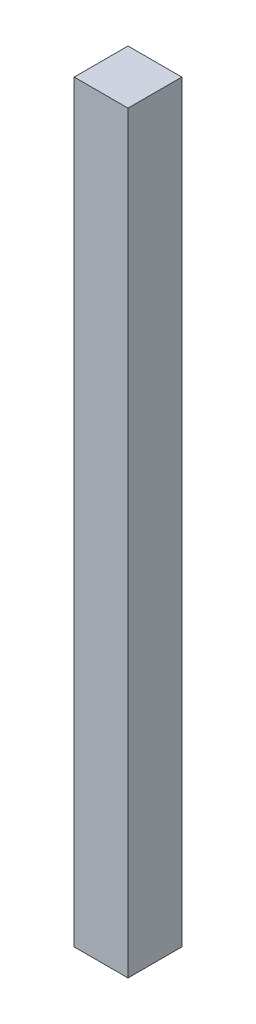
ISO-10303-21;
HEADER;
FILE_DESCRIPTION(('STEP AP214'),'2;1');
FILE_NAME('part.step','',(''),(''),'','','');
FILE_SCHEMA(('AUTOMOTIVE_DESIGN { 1 0 10303 214 1 1 1 1 }'));
ENDSEC;
DATA;
#1=APPLICATION_CONTEXT('core data for automotive mechanical design processes');
#2=APPLICATION_PROTOCOL_DEFINITION('international standard','automotive_design',2000,#1);
#3=PRODUCT_CONTEXT('',#1,'mechanical');
#4=PRODUCT('Part','Part','',(#3));
#5=PRODUCT_RELATED_PRODUCT_CATEGORY('part','',(#4));
#6=PRODUCT_DEFINITION_FORMATION('','',#4);
#7=PRODUCT_DEFINITION_CONTEXT('part definition',#1,'design');
#8=PRODUCT_DEFINITION('design','',#6,#7);
#9=PRODUCT_DEFINITION_SHAPE('','',#8);
#10=(LENGTH_UNIT() NAMED_UNIT(*) SI_UNIT(.MILLI.,.METRE.));
#11=(NAMED_UNIT(*) PLANE_ANGLE_UNIT() SI_UNIT($,.RADIAN.));
#12=(NAMED_UNIT(*) SI_UNIT($,.STERADIAN.) SOLID_ANGLE_UNIT());
#13=UNCERTAINTY_MEASURE_WITH_UNIT(LENGTH_MEASURE(1.E-05),#10,'distance_accuracy_value','');
#14=(GEOMETRIC_REPRESENTATION_CONTEXT(3) GLOBAL_UNCERTAINTY_ASSIGNED_CONTEXT((#13)) GLOBAL_UNIT_ASSIGNED_CONTEXT((#10,
#11,#12)) REPRESENTATION_CONTEXT('',''));
#15=CARTESIAN_POINT('',(0.,0.,0.));
#16=DIRECTION('',(0.,0.,1.));
#17=DIRECTION('',(1.,0.,0.));
#18=AXIS2_PLACEMENT_3D('',#15,#16,#17);
#19=CARTESIAN_POINT('',(-20.,560.,20.));
#20=DIRECTION('',(1.,0.,0.));
#21=DIRECTION('',(0.,0.,-1.));
#22=AXIS2_PLACEMENT_3D('',#19,#20,#21);
#23=PLANE('',#22);
#24=DIRECTION('',(0.,0.,1.));
#25=VECTOR('',#24,1.);
#26=CARTESIAN_POINT('',(-20.,0.,20.));
#27=LINE('',#26,#25);
#28=CARTESIAN_POINT('',(-20.,0.,-20.));
#29=VERTEX_POINT('',#28);
#30=CARTESIAN_POINT('',(-20.,0.,20.));
#31=VERTEX_POINT('',#30);
#32=EDGE_CURVE('E98',#29,#31,#27,.T.);
#33=ORIENTED_EDGE('',*,*,#32,.T.);
#34=DIRECTION('',(0.,-1.,0.));
#35=VECTOR('',#34,1.);
#36=CARTESIAN_POINT('',(-20.,560.,20.));
#37=LINE('',#36,#35);
#38=CARTESIAN_POINT('',(-20.,560.,20.));
#39=VERTEX_POINT('',#38);
#40=EDGE_CURVE('E11',#39,#31,#37,.T.);
#41=ORIENTED_EDGE('',*,*,#40,.F.);
#42=DIRECTION('',(0.,0.,1.));
#43=VECTOR('',#42,1.);
#44=CARTESIAN_POINT('',(-20.,560.,20.));
#45=LINE('',#44,#43);
#46=CARTESIAN_POINT('',(-20.,560.,-20.));
#47=VERTEX_POINT('',#46);
#48=EDGE_CURVE('E86',#47,#39,#45,.T.);
#49=ORIENTED_EDGE('',*,*,#48,.F.);
#50=DIRECTION('',(0.,-1.,0.));
#51=VECTOR('',#50,1.);
#52=CARTESIAN_POINT('',(-20.,560.,-20.));
#53=LINE('',#52,#51);
#54=EDGE_CURVE('E94',#47,#29,#53,.T.);
#55=ORIENTED_EDGE('',*,*,#54,.T.);
#56=EDGE_LOOP('',(#33,#41,#49,#55));
#57=FACE_BOUND('',#56,.T.);
#58=ADVANCED_FACE('F35',(#57),#23,.F.);
#59=CARTESIAN_POINT('',(20.,560.,20.));
#60=DIRECTION('',(0.,0.,-1.));
#61=DIRECTION('',(-1.,0.,0.));
#62=AXIS2_PLACEMENT_3D('',#59,#60,#61);
#63=PLANE('',#62);
#64=DIRECTION('',(1.,0.,0.));
#65=VECTOR('',#64,1.);
#66=CARTESIAN_POINT('',(20.,0.,20.));
#67=LINE('',#66,#65);
#68=CARTESIAN_POINT('',(20.,0.,20.));
#69=VERTEX_POINT('',#68);
#70=EDGE_CURVE('E90',#31,#69,#67,.T.);
#71=ORIENTED_EDGE('',*,*,#70,.T.);
#72=DIRECTION('',(0.,-1.,0.));
#73=VECTOR('',#72,1.);
#74=CARTESIAN_POINT('',(20.,560.,20.));
#75=LINE('',#74,#73);
#76=CARTESIAN_POINT('',(20.,560.,20.));
#77=VERTEX_POINT('',#76);
#78=EDGE_CURVE('E43',#77,#69,#75,.T.);
#79=ORIENTED_EDGE('',*,*,#78,.F.);
#80=DIRECTION('',(1.,0.,0.));
#81=VECTOR('',#80,1.);
#82=CARTESIAN_POINT('',(20.,560.,20.));
#83=LINE('',#82,#81);
#84=EDGE_CURVE('E81',#39,#77,#83,.T.);
#85=ORIENTED_EDGE('',*,*,#84,.F.);
#86=ORIENTED_EDGE('',*,*,#40,.T.);
#87=EDGE_LOOP('',(#71,#79,#85,#86));
#88=FACE_BOUND('',#87,.T.);
#89=ADVANCED_FACE('F89',(#88),#63,.F.);
#90=CARTESIAN_POINT('',(20.,560.,20.));
#91=DIRECTION('',(-1.,0.,0.));
#92=DIRECTION('',(0.,0.,1.));
#93=AXIS2_PLACEMENT_3D('',#90,#91,#92);
#94=PLANE('',#93);
#95=DIRECTION('',(0.,0.,-1.));
#96=VECTOR('',#95,1.);
#97=CARTESIAN_POINT('',(20.,0.,20.));
#98=LINE('',#97,#96);
#99=CARTESIAN_POINT('',(20.,0.,-20.));
#100=VERTEX_POINT('',#99);
#101=EDGE_CURVE('E68',#69,#100,#98,.T.);
#102=ORIENTED_EDGE('',*,*,#101,.T.);
#103=DIRECTION('',(0.,-1.,0.));
#104=VECTOR('',#103,1.);
#105=CARTESIAN_POINT('',(20.,560.,-20.));
#106=LINE('',#105,#104);
#107=CARTESIAN_POINT('',(20.,560.,-20.));
#108=VERTEX_POINT('',#107);
#109=EDGE_CURVE('E91',#108,#100,#106,.T.);
#110=ORIENTED_EDGE('',*,*,#109,.F.);
#111=DIRECTION('',(0.,0.,-1.));
#112=VECTOR('',#111,1.);
#113=CARTESIAN_POINT('',(20.,560.,20.));
#114=LINE('',#113,#112);
#115=EDGE_CURVE('E84',#77,#108,#114,.T.);
#116=ORIENTED_EDGE('',*,*,#115,.F.);
#117=ORIENTED_EDGE('',*,*,#78,.T.);
#118=EDGE_LOOP('',(#102,#110,#116,#117));
#119=FACE_BOUND('',#118,.T.);
#120=ADVANCED_FACE('F92',(#119),#94,.F.);
#121=CARTESIAN_POINT('',(20.,560.,-20.));
#122=DIRECTION('',(0.,0.,1.));
#123=DIRECTION('',(1.,0.,0.));
#124=AXIS2_PLACEMENT_3D('',#121,#122,#123);
#125=PLANE('',#124);
#126=DIRECTION('',(-1.,0.,0.));
#127=VECTOR('',#126,1.);
#128=CARTESIAN_POINT('',(20.,0.,-20.));
#129=LINE('',#128,#127);
#130=EDGE_CURVE('E74',#100,#29,#129,.T.);
#131=ORIENTED_EDGE('',*,*,#130,.T.);
#132=ORIENTED_EDGE('',*,*,#54,.F.);
#133=DIRECTION('',(-1.,0.,0.));
#134=VECTOR('',#133,1.);
#135=CARTESIAN_POINT('',(20.,560.,-20.));
#136=LINE('',#135,#134);
#137=EDGE_CURVE('E51',#108,#47,#136,.T.);
#138=ORIENTED_EDGE('',*,*,#137,.F.);
#139=ORIENTED_EDGE('',*,*,#109,.T.);
#140=EDGE_LOOP('',(#131,#132,#138,#139));
#141=FACE_BOUND('',#140,.T.);
#142=ADVANCED_FACE('F105',(#141),#125,.F.);
#143=CARTESIAN_POINT('',(0.,560.,0.));
#144=DIRECTION('',(0.,1.,0.));
#145=DIRECTION('',(0.,0.,1.));
#146=AXIS2_PLACEMENT_3D('',#143,#144,#145);
#147=PLANE('',#146);
#148=ORIENTED_EDGE('',*,*,#48,.T.);
#149=ORIENTED_EDGE('',*,*,#84,.T.);
#150=ORIENTED_EDGE('',*,*,#115,.T.);
#151=ORIENTED_EDGE('',*,*,#137,.T.);
#152=EDGE_LOOP('',(#148,#149,#150,#151));
#153=FACE_BOUND('',#152,.T.);
#154=ADVANCED_FACE('F82',(#153),#147,.T.);
#155=CARTESIAN_POINT('',(0.,0.,0.));
#156=DIRECTION('',(0.,1.,0.));
#157=DIRECTION('',(0.,0.,1.));
#158=AXIS2_PLACEMENT_3D('',#155,#156,#157);
#159=PLANE('',#158);
#160=ORIENTED_EDGE('',*,*,#32,.F.);
#161=ORIENTED_EDGE('',*,*,#130,.F.);
#162=ORIENTED_EDGE('',*,*,#101,.F.);
#163=ORIENTED_EDGE('',*,*,#70,.F.);
#164=EDGE_LOOP('',(#160,#161,#162,#163));
#165=FACE_BOUND('',#164,.T.);
#166=ADVANCED_FACE('F108',(#165),#159,.F.);
#167=CLOSED_SHELL('',(#58,#89,#120,#142,#154,#166));
#168=MANIFOLD_SOLID_BREP('B2',#167);
#169=ADVANCED_BREP_SHAPE_REPRESENTATION('',(#18,#168),#14);
#170=SHAPE_DEFINITION_REPRESENTATION(#9,#169);
ENDSEC;
END-ISO-10303-21;
